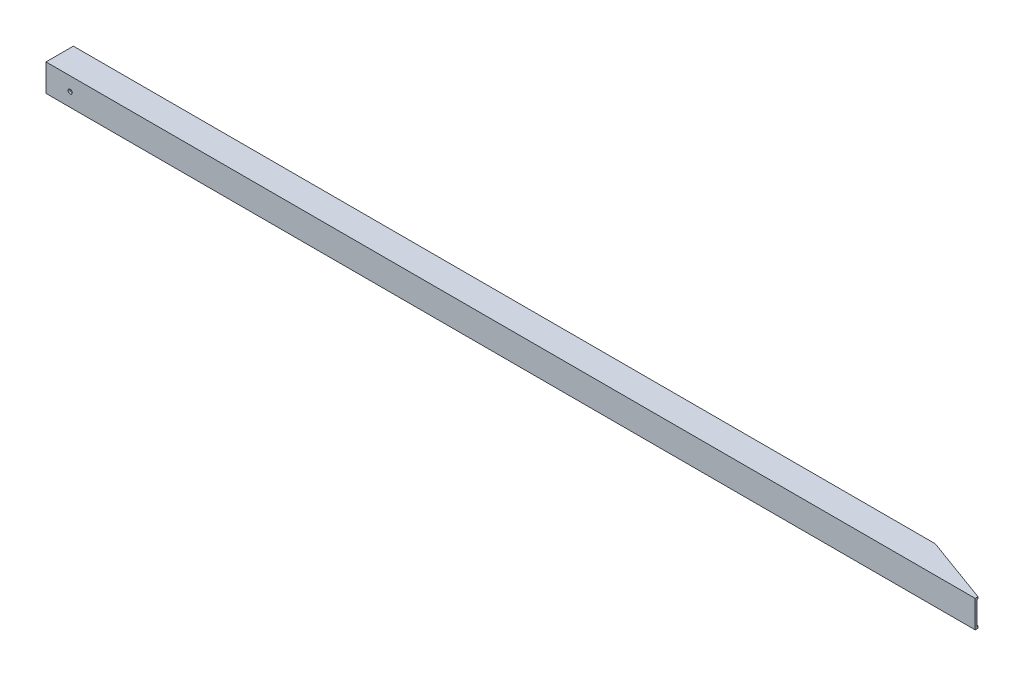
ISO-10303-21;
HEADER;
FILE_DESCRIPTION(('STEP AP214'),'2;1');
FILE_NAME('part.step','',(''),(''),'','','');
FILE_SCHEMA(('AUTOMOTIVE_DESIGN { 1 0 10303 214 1 1 1 1 }'));
ENDSEC;
DATA;
#1=APPLICATION_CONTEXT('core data for automotive mechanical design processes');
#2=APPLICATION_PROTOCOL_DEFINITION('international standard','automotive_design',2000,#1);
#3=PRODUCT_CONTEXT('',#1,'mechanical');
#4=PRODUCT('Part','Part','',(#3));
#5=PRODUCT_RELATED_PRODUCT_CATEGORY('part','',(#4));
#6=PRODUCT_DEFINITION_FORMATION('','',#4);
#7=PRODUCT_DEFINITION_CONTEXT('part definition',#1,'design');
#8=PRODUCT_DEFINITION('design','',#6,#7);
#9=PRODUCT_DEFINITION_SHAPE('','',#8);
#10=(LENGTH_UNIT() NAMED_UNIT(*) SI_UNIT(.MILLI.,.METRE.));
#11=(NAMED_UNIT(*) PLANE_ANGLE_UNIT() SI_UNIT($,.RADIAN.));
#12=(NAMED_UNIT(*) SI_UNIT($,.STERADIAN.) SOLID_ANGLE_UNIT());
#13=UNCERTAINTY_MEASURE_WITH_UNIT(LENGTH_MEASURE(1.E-05),#10,'distance_accuracy_value','');
#14=(GEOMETRIC_REPRESENTATION_CONTEXT(3) GLOBAL_UNCERTAINTY_ASSIGNED_CONTEXT((#13)) GLOBAL_UNIT_ASSIGNED_CONTEXT((#10,
#11,#12)) REPRESENTATION_CONTEXT('',''));
#15=CARTESIAN_POINT('',(0.,0.,0.));
#16=DIRECTION('',(0.,0.,1.));
#17=DIRECTION('',(1.,0.,0.));
#18=AXIS2_PLACEMENT_3D('',#15,#16,#17);
#19=CARTESIAN_POINT('',(0.,0.,0.));
#20=DIRECTION('',(-1.,0.,0.));
#21=DIRECTION('',(0.,0.,1.));
#22=AXIS2_PLACEMENT_3D('',#19,#20,#21);
#23=PLANE('',#22);
#24=DIRECTION('',(0.,-1.,0.));
#25=VECTOR('',#24,1.);
#26=CARTESIAN_POINT('',(0.,0.,0.));
#27=LINE('',#26,#25);
#28=CARTESIAN_POINT('',(0.,44.45,0.));
#29=VERTEX_POINT('',#28);
#30=CARTESIAN_POINT('',(0.,0.,0.));
#31=VERTEX_POINT('',#30);
#32=EDGE_CURVE('E131',#29,#31,#27,.T.);
#33=ORIENTED_EDGE('',*,*,#32,.F.);
#34=DIRECTION('',(0.,0.,1.));
#35=VECTOR('',#34,1.);
#36=CARTESIAN_POINT('',(0.,44.45,0.));
#37=LINE('',#36,#35);
#38=CARTESIAN_POINT('',(0.,44.45,-44.45));
#39=VERTEX_POINT('',#38);
#40=EDGE_CURVE('E192',#39,#29,#37,.T.);
#41=ORIENTED_EDGE('',*,*,#40,.F.);
#42=DIRECTION('',(0.,1.,0.));
#43=VECTOR('',#42,1.);
#44=CARTESIAN_POINT('',(0.,0.,-44.45));
#45=LINE('',#44,#43);
#46=CARTESIAN_POINT('',(0.,0.,-44.45));
#47=VERTEX_POINT('',#46);
#48=EDGE_CURVE('E189',#47,#39,#45,.T.);
#49=ORIENTED_EDGE('',*,*,#48,.F.);
#50=DIRECTION('',(0.,0.,-1.));
#51=VECTOR('',#50,1.);
#52=CARTESIAN_POINT('',(0.,0.,0.));
#53=LINE('',#52,#51);
#54=EDGE_CURVE('E187',#31,#47,#53,.T.);
#55=ORIENTED_EDGE('',*,*,#54,.F.);
#56=EDGE_LOOP('',(#33,#41,#49,#55));
#57=FACE_BOUND('',#56,.T.);
#58=DIRECTION('',(0.,-1.,0.));
#59=VECTOR('',#58,1.);
#60=CARTESIAN_POINT('',(0.,3.175,-3.175));
#61=LINE('',#60,#59);
#62=CARTESIAN_POINT('',(0.,41.275,-3.175));
#63=VERTEX_POINT('',#62);
#64=CARTESIAN_POINT('',(0.,3.175,-3.175));
#65=VERTEX_POINT('',#64);
#66=EDGE_CURVE('E175',#63,#65,#61,.T.);
#67=ORIENTED_EDGE('',*,*,#66,.T.);
#68=DIRECTION('',(0.,0.,-1.));
#69=VECTOR('',#68,1.);
#70=CARTESIAN_POINT('',(0.,3.175,-3.175));
#71=LINE('',#70,#69);
#72=CARTESIAN_POINT('',(0.,3.175,-41.275));
#73=VERTEX_POINT('',#72);
#74=EDGE_CURVE('E166',#65,#73,#71,.T.);
#75=ORIENTED_EDGE('',*,*,#74,.T.);
#76=DIRECTION('',(0.,1.,0.));
#77=VECTOR('',#76,1.);
#78=CARTESIAN_POINT('',(0.,3.175,-41.275));
#79=LINE('',#78,#77);
#80=CARTESIAN_POINT('',(0.,41.275,-41.275));
#81=VERTEX_POINT('',#80);
#82=EDGE_CURVE('E169',#73,#81,#79,.T.);
#83=ORIENTED_EDGE('',*,*,#82,.T.);
#84=DIRECTION('',(0.,0.,1.));
#85=VECTOR('',#84,1.);
#86=CARTESIAN_POINT('',(0.,41.275,-3.175));
#87=LINE('',#86,#85);
#88=EDGE_CURVE('E172',#81,#63,#87,.T.);
#89=ORIENTED_EDGE('',*,*,#88,.T.);
#90=EDGE_LOOP('',(#67,#75,#83,#89));
#91=FACE_BOUND('',#90,.T.);
#92=ADVANCED_FACE('F35',(#57,#91),#23,.T.);
#93=CARTESIAN_POINT('',(1524.,0.,0.));
#94=DIRECTION('',(0.,0.,-1.));
#95=DIRECTION('',(-1.,0.,0.));
#96=AXIS2_PLACEMENT_3D('',#93,#94,#95);
#97=PLANE('',#96);
#98=CARTESIAN_POINT('',(39.37,22.225,0.));
#99=DIRECTION('',(0.,0.,1.));
#100=DIRECTION('',(1.,0.,0.));
#101=AXIS2_PLACEMENT_3D('',#98,#99,#100);
#102=CIRCLE('',#101,3.37819999999999);
#103=CARTESIAN_POINT('',(42.7482,22.225,0.));
#104=VERTEX_POINT('',#103);
#105=EDGE_CURVE('E147',#104,#104,#102,.T.);
#106=ORIENTED_EDGE('',*,*,#105,.F.);
#107=EDGE_LOOP('',(#106));
#108=FACE_BOUND('',#107,.T.);
#109=DIRECTION('',(-1.,0.,0.));
#110=VECTOR('',#109,1.);
#111=CARTESIAN_POINT('',(1524.,0.,0.));
#112=LINE('',#111,#110);
#113=CARTESIAN_POINT('',(1511.3,0.,0.));
#114=VERTEX_POINT('',#113);
#115=EDGE_CURVE('E43',#114,#31,#112,.T.);
#116=ORIENTED_EDGE('',*,*,#115,.F.);
#117=DIRECTION('',(0.,1.,0.));
#118=VECTOR('',#117,1.);
#119=CARTESIAN_POINT('',(1511.3,0.,0.));
#120=LINE('',#119,#118);
#121=CARTESIAN_POINT('',(1511.3,44.45,0.));
#122=VERTEX_POINT('',#121);
#123=EDGE_CURVE('E111',#114,#122,#120,.T.);
#124=ORIENTED_EDGE('',*,*,#123,.T.);
#125=DIRECTION('',(-1.,0.,0.));
#126=VECTOR('',#125,1.);
#127=CARTESIAN_POINT('',(1524.,44.45,0.));
#128=LINE('',#127,#126);
#129=EDGE_CURVE('E195',#122,#29,#128,.T.);
#130=ORIENTED_EDGE('',*,*,#129,.T.);
#131=ORIENTED_EDGE('',*,*,#32,.T.);
#132=EDGE_LOOP('',(#116,#124,#130,#131));
#133=FACE_BOUND('',#132,.T.);
#134=ADVANCED_FACE('F37',(#108,#133),#97,.F.);
#135=CARTESIAN_POINT('',(1524.,0.,0.));
#136=DIRECTION('',(0.,1.,0.));
#137=DIRECTION('',(0.,0.,1.));
#138=AXIS2_PLACEMENT_3D('',#135,#136,#137);
#139=PLANE('',#138);
#140=DIRECTION('',(0.939692620785908,0.,0.342020143325669));
#141=VECTOR('',#140,1.);
#142=CARTESIAN_POINT('',(1524.,0.,0.));
#143=LINE('',#142,#141);
#144=CARTESIAN_POINT('',(1401.87462870524,0.,-44.45));
#145=VERTEX_POINT('',#144);
#146=CARTESIAN_POINT('',(1511.3,0.,-4.62242197518075));
#147=VERTEX_POINT('',#146);
#148=EDGE_CURVE('E127',#145,#147,#143,.T.);
#149=ORIENTED_EDGE('',*,*,#148,.T.);
#150=DIRECTION('',(0.,0.,1.));
#151=VECTOR('',#150,1.);
#152=CARTESIAN_POINT('',(1511.3,0.,0.));
#153=LINE('',#152,#151);
#154=EDGE_CURVE('E50',#147,#114,#153,.T.);
#155=ORIENTED_EDGE('',*,*,#154,.T.);
#156=ORIENTED_EDGE('',*,*,#115,.T.);
#157=ORIENTED_EDGE('',*,*,#54,.T.);
#158=DIRECTION('',(-1.,0.,0.));
#159=VECTOR('',#158,1.);
#160=CARTESIAN_POINT('',(1524.,0.,-44.45));
#161=LINE('',#160,#159);
#162=EDGE_CURVE('E132',#145,#47,#161,.T.);
#163=ORIENTED_EDGE('',*,*,#162,.F.);
#164=EDGE_LOOP('',(#149,#155,#156,#157,#163));
#165=FACE_BOUND('',#164,.T.);
#166=ADVANCED_FACE('F123',(#165),#139,.F.);
#167=CARTESIAN_POINT('',(1524.,0.,-44.45));
#168=DIRECTION('',(0.,0.,1.));
#169=DIRECTION('',(1.,0.,0.));
#170=AXIS2_PLACEMENT_3D('',#167,#168,#169);
#171=PLANE('',#170);
#172=CARTESIAN_POINT('',(39.37,22.225,-44.45));
#173=DIRECTION('',(0.,0.,1.));
#174=DIRECTION('',(1.,0.,0.));
#175=AXIS2_PLACEMENT_3D('',#172,#173,#174);
#176=CIRCLE('',#175,3.37819999999998);
#177=CARTESIAN_POINT('',(42.7482,22.225,-44.45));
#178=VERTEX_POINT('',#177);
#179=EDGE_CURVE('E140',#178,#178,#176,.T.);
#180=ORIENTED_EDGE('',*,*,#179,.T.);
#181=EDGE_LOOP('',(#180));
#182=FACE_BOUND('',#181,.T.);
#183=DIRECTION('',(-1.,0.,0.));
#184=VECTOR('',#183,1.);
#185=CARTESIAN_POINT('',(1524.,44.45,-44.45));
#186=LINE('',#185,#184);
#187=CARTESIAN_POINT('',(1401.87462870524,44.45,-44.45));
#188=VERTEX_POINT('',#187);
#189=EDGE_CURVE('E134',#188,#39,#186,.T.);
#190=ORIENTED_EDGE('',*,*,#189,.F.);
#191=DIRECTION('',(0.,1.,0.));
#192=VECTOR('',#191,1.);
#193=CARTESIAN_POINT('',(1401.87462870524,0.,-44.45));
#194=LINE('',#193,#192);
#195=EDGE_CURVE('E58',#145,#188,#194,.T.);
#196=ORIENTED_EDGE('',*,*,#195,.F.);
#197=ORIENTED_EDGE('',*,*,#162,.T.);
#198=ORIENTED_EDGE('',*,*,#48,.T.);
#199=EDGE_LOOP('',(#190,#196,#197,#198));
#200=FACE_BOUND('',#199,.T.);
#201=ADVANCED_FACE('F202',(#182,#200),#171,.F.);
#202=CARTESIAN_POINT('',(1524.,44.45,0.));
#203=DIRECTION('',(0.,-1.,0.));
#204=DIRECTION('',(0.,0.,-1.));
#205=AXIS2_PLACEMENT_3D('',#202,#203,#204);
#206=PLANE('',#205);
#207=ORIENTED_EDGE('',*,*,#129,.F.);
#208=DIRECTION('',(0.,0.,1.));
#209=VECTOR('',#208,1.);
#210=CARTESIAN_POINT('',(1511.3,44.45,0.));
#211=LINE('',#210,#209);
#212=CARTESIAN_POINT('',(1511.3,44.45,-4.62242197518076));
#213=VERTEX_POINT('',#212);
#214=EDGE_CURVE('E114',#213,#122,#211,.T.);
#215=ORIENTED_EDGE('',*,*,#214,.F.);
#216=DIRECTION('',(0.939692620785908,0.,0.342020143325669));
#217=VECTOR('',#216,1.);
#218=CARTESIAN_POINT('',(1524.,44.45,0.));
#219=LINE('',#218,#217);
#220=EDGE_CURVE('E144',#188,#213,#219,.T.);
#221=ORIENTED_EDGE('',*,*,#220,.F.);
#222=ORIENTED_EDGE('',*,*,#189,.T.);
#223=ORIENTED_EDGE('',*,*,#40,.T.);
#224=EDGE_LOOP('',(#207,#215,#221,#222,#223));
#225=FACE_BOUND('',#224,.T.);
#226=ADVANCED_FACE('F198',(#225),#206,.F.);
#227=CARTESIAN_POINT('',(1524.,3.175,-3.175));
#228=DIRECTION('',(0.,1.,0.));
#229=DIRECTION('',(0.,0.,1.));
#230=AXIS2_PLACEMENT_3D('',#227,#228,#229);
#231=PLANE('',#230);
#232=DIRECTION('',(0.,0.,1.));
#233=VECTOR('',#232,1.);
#234=CARTESIAN_POINT('',(1511.3,3.175,-3.175));
#235=LINE('',#234,#233);
#236=CARTESIAN_POINT('',(1511.3,3.175,-4.62242197518076));
#237=VERTEX_POINT('',#236);
#238=CARTESIAN_POINT('',(1511.3,3.175,-3.175));
#239=VERTEX_POINT('',#238);
#240=EDGE_CURVE('E152',#237,#239,#235,.T.);
#241=ORIENTED_EDGE('',*,*,#240,.F.);
#242=DIRECTION('',(0.939692620785908,0.,0.342020143325669));
#243=VECTOR('',#242,1.);
#244=CARTESIAN_POINT('',(1522.97957466962,3.175,-0.371404446548624));
#245=LINE('',#244,#243);
#246=CARTESIAN_POINT('',(1410.59786951201,3.175,-41.275));
#247=VERTEX_POINT('',#246);
#248=EDGE_CURVE('E163',#247,#237,#245,.T.);
#249=ORIENTED_EDGE('',*,*,#248,.F.);
#250=DIRECTION('',(-1.,0.,0.));
#251=VECTOR('',#250,1.);
#252=CARTESIAN_POINT('',(1524.,3.175,-41.275));
#253=LINE('',#252,#251);
#254=EDGE_CURVE('E184',#247,#73,#253,.T.);
#255=ORIENTED_EDGE('',*,*,#254,.T.);
#256=ORIENTED_EDGE('',*,*,#74,.F.);
#257=DIRECTION('',(-1.,0.,0.));
#258=VECTOR('',#257,1.);
#259=CARTESIAN_POINT('',(1524.,3.175,-3.175));
#260=LINE('',#259,#258);
#261=EDGE_CURVE('E178',#239,#65,#260,.T.);
#262=ORIENTED_EDGE('',*,*,#261,.F.);
#263=EDGE_LOOP('',(#241,#249,#255,#256,#262));
#264=FACE_BOUND('',#263,.T.);
#265=ADVANCED_FACE('F218',(#264),#231,.T.);
#266=CARTESIAN_POINT('',(1524.,3.175,-41.275));
#267=DIRECTION('',(0.,0.,1.));
#268=DIRECTION('',(1.,0.,0.));
#269=AXIS2_PLACEMENT_3D('',#266,#267,#268);
#270=PLANE('',#269);
#271=CARTESIAN_POINT('',(39.37,22.225,-41.275));
#272=DIRECTION('',(0.,0.,1.));
#273=DIRECTION('',(1.,0.,0.));
#274=AXIS2_PLACEMENT_3D('',#271,#272,#273);
#275=CIRCLE('',#274,3.37819999999999);
#276=CARTESIAN_POINT('',(42.7482,22.225,-41.275));
#277=VERTEX_POINT('',#276);
#278=EDGE_CURVE('E139',#277,#277,#275,.T.);
#279=ORIENTED_EDGE('',*,*,#278,.F.);
#280=EDGE_LOOP('',(#279));
#281=FACE_BOUND('',#280,.T.);
#282=DIRECTION('',(0.,-1.,0.));
#283=VECTOR('',#282,1.);
#284=CARTESIAN_POINT('',(1410.59786951201,3.175,-41.275));
#285=LINE('',#284,#283);
#286=CARTESIAN_POINT('',(1410.59786951201,41.275,-41.275));
#287=VERTEX_POINT('',#286);
#288=EDGE_CURVE('E161',#287,#247,#285,.T.);
#289=ORIENTED_EDGE('',*,*,#288,.F.);
#290=DIRECTION('',(-1.,0.,0.));
#291=VECTOR('',#290,1.);
#292=CARTESIAN_POINT('',(1524.,41.275,-41.275));
#293=LINE('',#292,#291);
#294=EDGE_CURVE('E182',#287,#81,#293,.T.);
#295=ORIENTED_EDGE('',*,*,#294,.T.);
#296=ORIENTED_EDGE('',*,*,#82,.F.);
#297=ORIENTED_EDGE('',*,*,#254,.F.);
#298=EDGE_LOOP('',(#289,#295,#296,#297));
#299=FACE_BOUND('',#298,.T.);
#300=ADVANCED_FACE('F224',(#281,#299),#270,.T.);
#301=CARTESIAN_POINT('',(1524.,41.275,-3.175));
#302=DIRECTION('',(0.,-1.,0.));
#303=DIRECTION('',(0.,0.,-1.));
#304=AXIS2_PLACEMENT_3D('',#301,#302,#303);
#305=PLANE('',#304);
#306=DIRECTION('',(0.,0.,-1.));
#307=VECTOR('',#306,1.);
#308=CARTESIAN_POINT('',(1511.3,41.275,-3.175));
#309=LINE('',#308,#307);
#310=CARTESIAN_POINT('',(1511.3,41.275,-3.175));
#311=VERTEX_POINT('',#310);
#312=CARTESIAN_POINT('',(1511.3,41.275,-4.62242197518076));
#313=VERTEX_POINT('',#312);
#314=EDGE_CURVE('E230',#311,#313,#309,.T.);
#315=ORIENTED_EDGE('',*,*,#314,.F.);
#316=DIRECTION('',(-1.,0.,0.));
#317=VECTOR('',#316,1.);
#318=CARTESIAN_POINT('',(1524.,41.275,-3.175));
#319=LINE('',#318,#317);
#320=EDGE_CURVE('E180',#311,#63,#319,.T.);
#321=ORIENTED_EDGE('',*,*,#320,.T.);
#322=ORIENTED_EDGE('',*,*,#88,.F.);
#323=ORIENTED_EDGE('',*,*,#294,.F.);
#324=DIRECTION('',(-0.939692620785908,0.,-0.342020143325669));
#325=VECTOR('',#324,1.);
#326=CARTESIAN_POINT('',(1522.97957466962,41.275,-0.371404446548624));
#327=LINE('',#326,#325);
#328=EDGE_CURVE('E159',#313,#287,#327,.T.);
#329=ORIENTED_EDGE('',*,*,#328,.F.);
#330=EDGE_LOOP('',(#315,#321,#322,#323,#329));
#331=FACE_BOUND('',#330,.T.);
#332=ADVANCED_FACE('F229',(#331),#305,.T.);
#333=CARTESIAN_POINT('',(1524.,3.175,-3.175));
#334=DIRECTION('',(0.,0.,-1.));
#335=DIRECTION('',(-1.,0.,0.));
#336=AXIS2_PLACEMENT_3D('',#333,#334,#335);
#337=PLANE('',#336);
#338=DIRECTION('',(0.,1.,0.));
#339=VECTOR('',#338,1.);
#340=CARTESIAN_POINT('',(1511.3,3.175,-3.175));
#341=LINE('',#340,#339);
#342=EDGE_CURVE('E118',#239,#311,#341,.T.);
#343=ORIENTED_EDGE('',*,*,#342,.F.);
#344=ORIENTED_EDGE('',*,*,#261,.T.);
#345=ORIENTED_EDGE('',*,*,#66,.F.);
#346=ORIENTED_EDGE('',*,*,#320,.F.);
#347=EDGE_LOOP('',(#343,#344,#345,#346));
#348=FACE_BOUND('',#347,.T.);
#349=CARTESIAN_POINT('',(39.37,22.225,-3.175));
#350=DIRECTION('',(0.,0.,-1.));
#351=DIRECTION('',(-1.,0.,0.));
#352=AXIS2_PLACEMENT_3D('',#349,#350,#351);
#353=CIRCLE('',#352,3.37819999999999);
#354=CARTESIAN_POINT('',(35.9918,22.225,-3.175));
#355=VERTEX_POINT('',#354);
#356=EDGE_CURVE('E137',#355,#355,#353,.T.);
#357=ORIENTED_EDGE('',*,*,#356,.F.);
#358=EDGE_LOOP('',(#357));
#359=FACE_BOUND('',#358,.T.);
#360=ADVANCED_FACE('F213',(#348,#359),#337,.T.);
#361=CARTESIAN_POINT('',(1524.,0.,0.));
#362=DIRECTION('',(-0.342020143325669,0.,0.939692620785908));
#363=DIRECTION('',(0.939692620785908,0.,0.342020143325669));
#364=AXIS2_PLACEMENT_3D('',#361,#362,#363);
#365=PLANE('',#364);
#366=ORIENTED_EDGE('',*,*,#220,.T.);
#367=DIRECTION('',(0.,-1.,0.));
#368=VECTOR('',#367,1.);
#369=CARTESIAN_POINT('',(1511.3,0.,-4.62242197518076));
#370=LINE('',#369,#368);
#371=EDGE_CURVE('E11',#213,#313,#370,.T.);
#372=ORIENTED_EDGE('',*,*,#371,.T.);
#373=ORIENTED_EDGE('',*,*,#328,.T.);
#374=ORIENTED_EDGE('',*,*,#288,.T.);
#375=ORIENTED_EDGE('',*,*,#248,.T.);
#376=DIRECTION('',(0.,1.,0.));
#377=VECTOR('',#376,1.);
#378=CARTESIAN_POINT('',(1511.3,0.,-4.62242197518076));
#379=LINE('',#378,#377);
#380=EDGE_CURVE('E119',#147,#237,#379,.T.);
#381=ORIENTED_EDGE('',*,*,#380,.F.);
#382=ORIENTED_EDGE('',*,*,#148,.F.);
#383=ORIENTED_EDGE('',*,*,#195,.T.);
#384=EDGE_LOOP('',(#366,#372,#373,#374,#375,#381,#382,#383));
#385=FACE_BOUND('',#384,.T.);
#386=ADVANCED_FACE('F235',(#385),#365,.F.);
#387=CARTESIAN_POINT('',(39.37,22.225,0.));
#388=DIRECTION('',(0.,0.,1.));
#389=DIRECTION('',(1.,0.,0.));
#390=AXIS2_PLACEMENT_3D('',#387,#388,#389);
#391=CYLINDRICAL_SURFACE('',#390,3.37819999999999);
#392=ORIENTED_EDGE('',*,*,#356,.T.);
#393=EDGE_LOOP('',(#392));
#394=FACE_BOUND('',#393,.T.);
#395=ORIENTED_EDGE('',*,*,#105,.T.);
#396=EDGE_LOOP('',(#395));
#397=FACE_BOUND('',#396,.T.);
#398=ADVANCED_FACE('F237',(#394,#397),#391,.F.);
#399=ORIENTED_EDGE('',*,*,#278,.T.);
#400=EDGE_LOOP('',(#399));
#401=FACE_BOUND('',#400,.T.);
#402=ORIENTED_EDGE('',*,*,#179,.F.);
#403=EDGE_LOOP('',(#402));
#404=FACE_BOUND('',#403,.T.);
#405=ADVANCED_FACE('F243',(#401,#404),#391,.F.);
#406=CARTESIAN_POINT('',(1511.3,0.,0.));
#407=DIRECTION('',(-1.,0.,0.));
#408=DIRECTION('',(0.,0.,1.));
#409=AXIS2_PLACEMENT_3D('',#406,#407,#408);
#410=PLANE('',#409);
#411=ORIENTED_EDGE('',*,*,#240,.T.);
#412=ORIENTED_EDGE('',*,*,#342,.T.);
#413=ORIENTED_EDGE('',*,*,#314,.T.);
#414=ORIENTED_EDGE('',*,*,#371,.F.);
#415=ORIENTED_EDGE('',*,*,#214,.T.);
#416=ORIENTED_EDGE('',*,*,#123,.F.);
#417=ORIENTED_EDGE('',*,*,#154,.F.);
#418=ORIENTED_EDGE('',*,*,#380,.T.);
#419=EDGE_LOOP('',(#411,#412,#413,#414,#415,#416,#417,#418));
#420=FACE_BOUND('',#419,.T.);
#421=ADVANCED_FACE('F112',(#420),#410,.F.);
#422=CLOSED_SHELL('',(#92,#134,#166,#201,#226,#265,#300,#332,#360,#386,#398,#405,#421));
#423=MANIFOLD_SOLID_BREP('B2',#422);
#424=ADVANCED_BREP_SHAPE_REPRESENTATION('',(#18,#423),#14);
#425=SHAPE_DEFINITION_REPRESENTATION(#9,#424);
ENDSEC;
END-ISO-10303-21;
